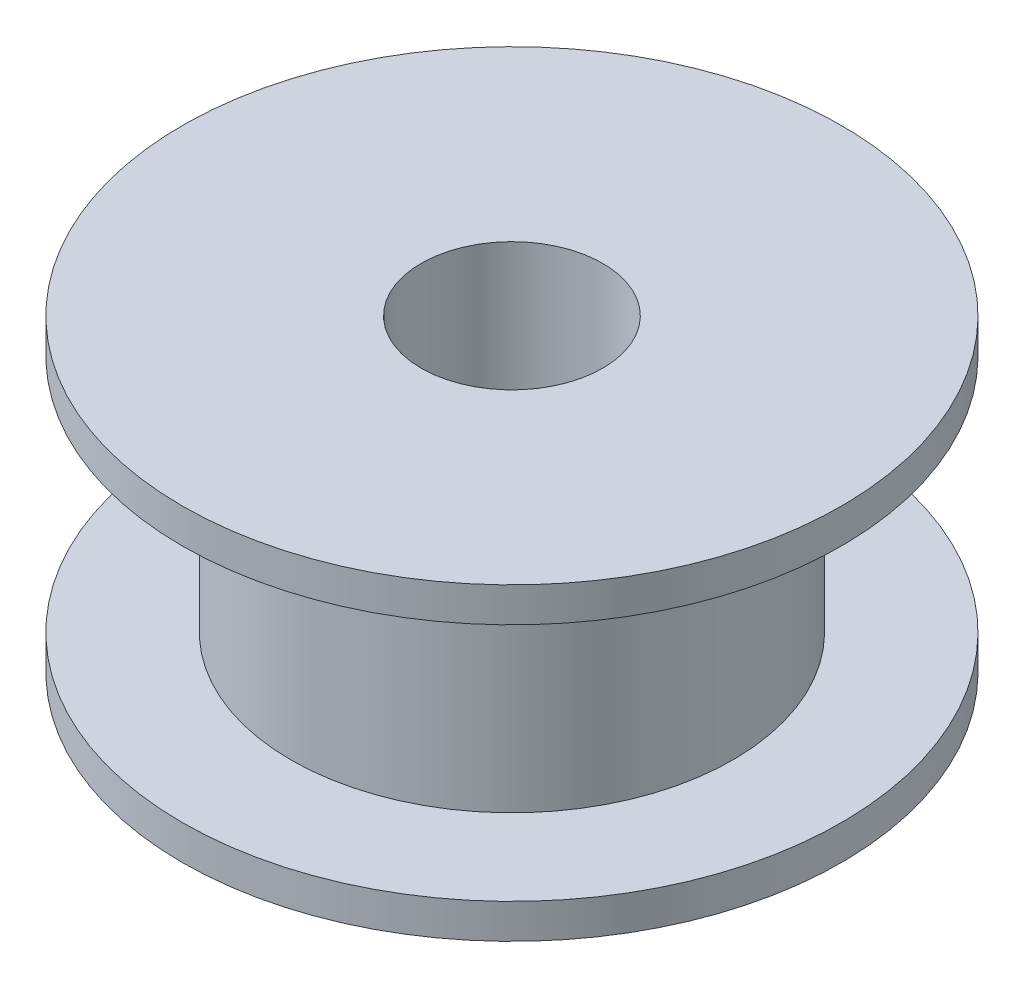
ISO-10303-21;
HEADER;
FILE_DESCRIPTION(('STEP AP214'),'2;1');
FILE_NAME('part.step','',(''),(''),'','','');
FILE_SCHEMA(('AUTOMOTIVE_DESIGN { 1 0 10303 214 1 1 1 1 }'));
ENDSEC;
DATA;
#1=APPLICATION_CONTEXT('core data for automotive mechanical design processes');
#2=APPLICATION_PROTOCOL_DEFINITION('international standard','automotive_design',2000,#1);
#3=PRODUCT_CONTEXT('',#1,'mechanical');
#4=PRODUCT('Part','Part','',(#3));
#5=PRODUCT_RELATED_PRODUCT_CATEGORY('part','',(#4));
#6=PRODUCT_DEFINITION_FORMATION('','',#4);
#7=PRODUCT_DEFINITION_CONTEXT('part definition',#1,'design');
#8=PRODUCT_DEFINITION('design','',#6,#7);
#9=PRODUCT_DEFINITION_SHAPE('','',#8);
#10=(LENGTH_UNIT() NAMED_UNIT(*) SI_UNIT(.MILLI.,.METRE.));
#11=(NAMED_UNIT(*) PLANE_ANGLE_UNIT() SI_UNIT($,.RADIAN.));
#12=(NAMED_UNIT(*) SI_UNIT($,.STERADIAN.) SOLID_ANGLE_UNIT());
#13=UNCERTAINTY_MEASURE_WITH_UNIT(LENGTH_MEASURE(1.E-05),#10,'distance_accuracy_value','');
#14=(GEOMETRIC_REPRESENTATION_CONTEXT(3) GLOBAL_UNCERTAINTY_ASSIGNED_CONTEXT((#13)) GLOBAL_UNIT_ASSIGNED_CONTEXT((#10,
#11,#12)) REPRESENTATION_CONTEXT('',''));
#15=CARTESIAN_POINT('',(0.,0.,0.));
#16=DIRECTION('',(0.,0.,1.));
#17=DIRECTION('',(1.,0.,0.));
#18=AXIS2_PLACEMENT_3D('',#15,#16,#17);
#19=CARTESIAN_POINT('',(0.,0.94,0.));
#20=DIRECTION('',(0.,-1.,0.));
#21=DIRECTION('',(0.,0.,-1.));
#22=AXIS2_PLACEMENT_3D('',#19,#20,#21);
#23=CYLINDRICAL_SURFACE('',#22,8.945);
#24=CARTESIAN_POINT('',(0.,0.94,0.));
#25=DIRECTION('',(0.,1.,0.));
#26=DIRECTION('',(0.,0.,1.));
#27=AXIS2_PLACEMENT_3D('',#24,#25,#26);
#28=CIRCLE('',#27,8.945);
#29=CARTESIAN_POINT('',(0.,0.94,8.945));
#30=VERTEX_POINT('',#29);
#31=EDGE_CURVE('E39',#30,#30,#28,.T.);
#32=ORIENTED_EDGE('',*,*,#31,.F.);
#33=EDGE_LOOP('',(#32));
#34=FACE_BOUND('',#33,.T.);
#35=CARTESIAN_POINT('',(0.,0.,0.));
#36=DIRECTION('',(0.,1.,0.));
#37=DIRECTION('',(0.,0.,1.));
#38=AXIS2_PLACEMENT_3D('',#35,#36,#37);
#39=CIRCLE('',#38,8.945);
#40=CARTESIAN_POINT('',(0.,0.,8.945));
#41=VERTEX_POINT('',#40);
#42=EDGE_CURVE('E35',#41,#41,#39,.T.);
#43=ORIENTED_EDGE('',*,*,#42,.T.);
#44=EDGE_LOOP('',(#43));
#45=FACE_BOUND('',#44,.T.);
#46=ADVANCED_FACE('F32',(#34,#45),#23,.T.);
#47=CARTESIAN_POINT('',(0.,0.94,0.));
#48=DIRECTION('',(0.,1.,0.));
#49=DIRECTION('',(0.,0.,1.));
#50=AXIS2_PLACEMENT_3D('',#47,#48,#49);
#51=PLANE('',#50);
#52=CARTESIAN_POINT('',(0.,0.94,0.));
#53=DIRECTION('',(0.,1.,0.));
#54=DIRECTION('',(0.,0.,1.));
#55=AXIS2_PLACEMENT_3D('',#52,#53,#54);
#56=CIRCLE('',#55,6.);
#57=CARTESIAN_POINT('',(0.,0.94,6.));
#58=VERTEX_POINT('',#57);
#59=EDGE_CURVE('E10',#58,#58,#56,.T.);
#60=ORIENTED_EDGE('',*,*,#59,.F.);
#61=EDGE_LOOP('',(#60));
#62=FACE_BOUND('',#61,.T.);
#63=ORIENTED_EDGE('',*,*,#31,.T.);
#64=EDGE_LOOP('',(#63));
#65=FACE_BOUND('',#64,.T.);
#66=ADVANCED_FACE('F90',(#62,#65),#51,.T.);
#67=CARTESIAN_POINT('',(0.,0.,0.));
#68=DIRECTION('',(0.,1.,0.));
#69=DIRECTION('',(0.,0.,1.));
#70=AXIS2_PLACEMENT_3D('',#67,#68,#69);
#71=PLANE('',#70);
#72=CARTESIAN_POINT('',(0.,0.,0.));
#73=DIRECTION('',(0.,1.,0.));
#74=DIRECTION('',(0.,0.,1.));
#75=AXIS2_PLACEMENT_3D('',#72,#73,#74);
#76=CIRCLE('',#75,2.465);
#77=CARTESIAN_POINT('',(0.,0.,2.465));
#78=VERTEX_POINT('',#77);
#79=EDGE_CURVE('E52',#78,#78,#76,.T.);
#80=ORIENTED_EDGE('',*,*,#79,.T.);
#81=EDGE_LOOP('',(#80));
#82=FACE_BOUND('',#81,.T.);
#83=ORIENTED_EDGE('',*,*,#42,.F.);
#84=EDGE_LOOP('',(#83));
#85=FACE_BOUND('',#84,.T.);
#86=ADVANCED_FACE('F61',(#82,#85),#71,.F.);
#87=CARTESIAN_POINT('',(0.,7.44,0.));
#88=DIRECTION('',(0.,-1.,0.));
#89=DIRECTION('',(0.,0.,-1.));
#90=AXIS2_PLACEMENT_3D('',#87,#88,#89);
#91=CYLINDRICAL_SURFACE('',#90,6.);
#92=CARTESIAN_POINT('',(0.,7.44,0.));
#93=DIRECTION('',(0.,1.,0.));
#94=DIRECTION('',(0.,0.,1.));
#95=AXIS2_PLACEMENT_3D('',#92,#93,#94);
#96=CIRCLE('',#95,6.);
#97=CARTESIAN_POINT('',(0.,7.44,6.));
#98=VERTEX_POINT('',#97);
#99=EDGE_CURVE('E45',#98,#98,#96,.T.);
#100=ORIENTED_EDGE('',*,*,#99,.F.);
#101=EDGE_LOOP('',(#100));
#102=FACE_BOUND('',#101,.T.);
#103=ORIENTED_EDGE('',*,*,#59,.T.);
#104=EDGE_LOOP('',(#103));
#105=FACE_BOUND('',#104,.T.);
#106=ADVANCED_FACE('F80',(#102,#105),#91,.T.);
#107=CARTESIAN_POINT('',(0.,8.38,0.));
#108=DIRECTION('',(0.,-1.,0.));
#109=DIRECTION('',(0.,0.,-1.));
#110=AXIS2_PLACEMENT_3D('',#107,#108,#109);
#111=CYLINDRICAL_SURFACE('',#110,8.94500000000001);
#112=CARTESIAN_POINT('',(0.,8.38,0.));
#113=DIRECTION('',(0.,1.,0.));
#114=DIRECTION('',(0.,0.,1.));
#115=AXIS2_PLACEMENT_3D('',#112,#113,#114);
#116=CIRCLE('',#115,8.94500000000001);
#117=CARTESIAN_POINT('',(0.,8.38,8.94500000000001));
#118=VERTEX_POINT('',#117);
#119=EDGE_CURVE('E48',#118,#118,#116,.T.);
#120=ORIENTED_EDGE('',*,*,#119,.F.);
#121=EDGE_LOOP('',(#120));
#122=FACE_BOUND('',#121,.T.);
#123=CARTESIAN_POINT('',(0.,7.44,0.));
#124=DIRECTION('',(0.,1.,0.));
#125=DIRECTION('',(0.,0.,1.));
#126=AXIS2_PLACEMENT_3D('',#123,#124,#125);
#127=CIRCLE('',#126,8.94500000000001);
#128=CARTESIAN_POINT('',(0.,7.44,8.94500000000001));
#129=VERTEX_POINT('',#128);
#130=EDGE_CURVE('E49',#129,#129,#127,.T.);
#131=ORIENTED_EDGE('',*,*,#130,.T.);
#132=EDGE_LOOP('',(#131));
#133=FACE_BOUND('',#132,.T.);
#134=ADVANCED_FACE('F74',(#122,#133),#111,.T.);
#135=CARTESIAN_POINT('',(0.,8.38,0.));
#136=DIRECTION('',(0.,1.,0.));
#137=DIRECTION('',(0.,0.,1.));
#138=AXIS2_PLACEMENT_3D('',#135,#136,#137);
#139=PLANE('',#138);
#140=CARTESIAN_POINT('',(0.,8.38,0.));
#141=DIRECTION('',(0.,1.,0.));
#142=DIRECTION('',(0.,0.,1.));
#143=AXIS2_PLACEMENT_3D('',#140,#141,#142);
#144=CIRCLE('',#143,2.465);
#145=CARTESIAN_POINT('',(0.,8.38,2.465));
#146=VERTEX_POINT('',#145);
#147=EDGE_CURVE('E55',#146,#146,#144,.T.);
#148=ORIENTED_EDGE('',*,*,#147,.F.);
#149=EDGE_LOOP('',(#148));
#150=FACE_BOUND('',#149,.T.);
#151=ORIENTED_EDGE('',*,*,#119,.T.);
#152=EDGE_LOOP('',(#151));
#153=FACE_BOUND('',#152,.T.);
#154=ADVANCED_FACE('F71',(#150,#153),#139,.T.);
#155=CARTESIAN_POINT('',(0.,7.44,0.));
#156=DIRECTION('',(0.,1.,0.));
#157=DIRECTION('',(0.,0.,1.));
#158=AXIS2_PLACEMENT_3D('',#155,#156,#157);
#159=PLANE('',#158);
#160=ORIENTED_EDGE('',*,*,#99,.T.);
#161=EDGE_LOOP('',(#160));
#162=FACE_BOUND('',#161,.T.);
#163=ORIENTED_EDGE('',*,*,#130,.F.);
#164=EDGE_LOOP('',(#163));
#165=FACE_BOUND('',#164,.T.);
#166=ADVANCED_FACE('F67',(#162,#165),#159,.F.);
#167=CARTESIAN_POINT('',(0.,0.,0.));
#168=DIRECTION('',(0.,1.,0.));
#169=DIRECTION('',(0.,0.,1.));
#170=AXIS2_PLACEMENT_3D('',#167,#168,#169);
#171=CYLINDRICAL_SURFACE('',#170,2.465);
#172=ORIENTED_EDGE('',*,*,#79,.F.);
#173=EDGE_LOOP('',(#172));
#174=FACE_BOUND('',#173,.T.);
#175=ORIENTED_EDGE('',*,*,#147,.T.);
#176=EDGE_LOOP('',(#175));
#177=FACE_BOUND('',#176,.T.);
#178=ADVANCED_FACE('F64',(#174,#177),#171,.F.);
#179=CLOSED_SHELL('',(#46,#66,#86,#106,#134,#154,#166,#178));
#180=MANIFOLD_SOLID_BREP('B2',#179);
#181=ADVANCED_BREP_SHAPE_REPRESENTATION('',(#18,#180),#14);
#182=SHAPE_DEFINITION_REPRESENTATION(#9,#181);
ENDSEC;
END-ISO-10303-21;
